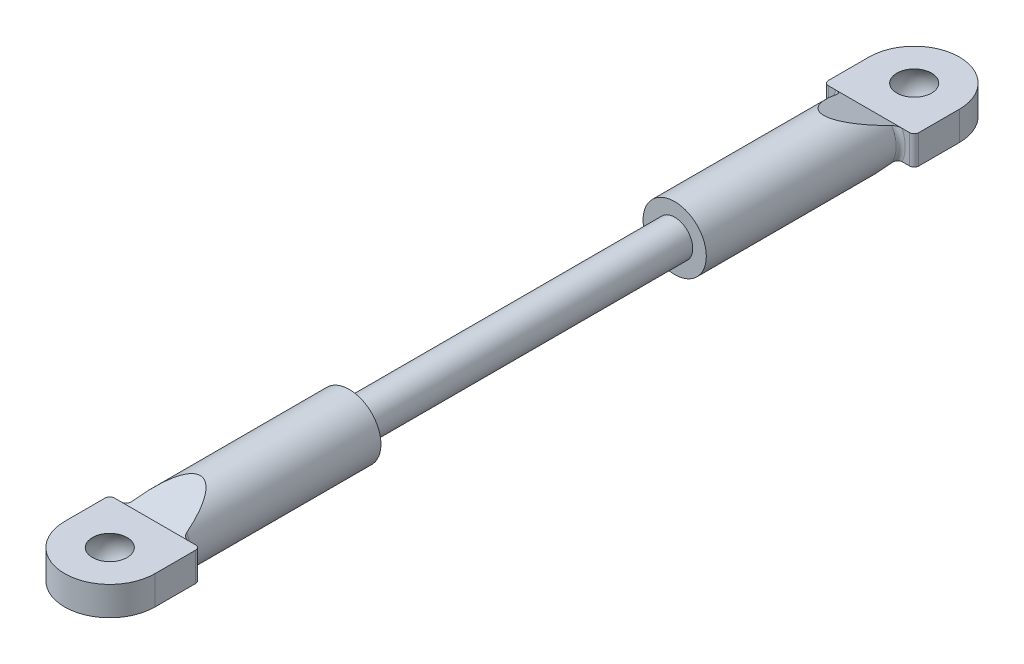
ISO-10303-21;
HEADER;
FILE_DESCRIPTION(('STEP AP214'),'2;1');
FILE_NAME('part.step','',(''),(''),'','','');
FILE_SCHEMA(('AUTOMOTIVE_DESIGN { 1 0 10303 214 1 1 1 1 }'));
ENDSEC;
DATA;
#1=APPLICATION_CONTEXT('core data for automotive mechanical design processes');
#2=APPLICATION_PROTOCOL_DEFINITION('international standard','automotive_design',2000,#1);
#3=PRODUCT_CONTEXT('',#1,'mechanical');
#4=PRODUCT('Part','Part','',(#3));
#5=PRODUCT_RELATED_PRODUCT_CATEGORY('part','',(#4));
#6=PRODUCT_DEFINITION_FORMATION('','',#4);
#7=PRODUCT_DEFINITION_CONTEXT('part definition',#1,'design');
#8=PRODUCT_DEFINITION('design','',#6,#7);
#9=PRODUCT_DEFINITION_SHAPE('','',#8);
#10=(LENGTH_UNIT() NAMED_UNIT(*) SI_UNIT(.MILLI.,.METRE.));
#11=(NAMED_UNIT(*) PLANE_ANGLE_UNIT() SI_UNIT($,.RADIAN.));
#12=(NAMED_UNIT(*) SI_UNIT($,.STERADIAN.) SOLID_ANGLE_UNIT());
#13=UNCERTAINTY_MEASURE_WITH_UNIT(LENGTH_MEASURE(1.E-05),#10,'distance_accuracy_value','');
#14=(GEOMETRIC_REPRESENTATION_CONTEXT(3) GLOBAL_UNCERTAINTY_ASSIGNED_CONTEXT((#13)) GLOBAL_UNIT_ASSIGNED_CONTEXT((#10,
#11,#12)) REPRESENTATION_CONTEXT('',''));
#15=CARTESIAN_POINT('',(0.,0.,0.));
#16=DIRECTION('',(0.,0.,1.));
#17=DIRECTION('',(1.,0.,0.));
#18=AXIS2_PLACEMENT_3D('',#15,#16,#17);
#19=CARTESIAN_POINT('',(0.,0.,-39.5));
#20=DIRECTION('',(0.,0.,1.));
#21=DIRECTION('',(1.,0.,0.));
#22=AXIS2_PLACEMENT_3D('',#19,#20,#21);
#23=CYLINDRICAL_SURFACE('',#22,3.5);
#24=CARTESIAN_POINT('',(0.,0.,-18.));
#25=DIRECTION('',(0.,0.,1.));
#26=DIRECTION('',(1.,0.,0.));
#27=AXIS2_PLACEMENT_3D('',#24,#25,#26);
#28=CIRCLE('',#27,3.5);
#29=CARTESIAN_POINT('',(3.5,0.,-18.));
#30=VERTEX_POINT('',#29);
#31=EDGE_CURVE('E186',#30,#30,#28,.T.);
#32=ORIENTED_EDGE('',*,*,#31,.F.);
#33=EDGE_LOOP('',(#32));
#34=FACE_BOUND('',#33,.T.);
#35=CARTESIAN_POINT('',(0.,0.,-43.7105263157895));
#36=DIRECTION('',(0.,0.934783580588349,-0.355217760623573));
#37=DIRECTION('',(0.,0.355217760623573,0.934783580588349));
#38=AXIS2_PLACEMENT_3D('',#35,#36,#37);
#39=ELLIPSE('',#38,9.85311093075939,3.5);
#40=CARTESIAN_POINT('',(3.00764027104306,1.79,-39.));
#41=VERTEX_POINT('',#40);
#42=CARTESIAN_POINT('',(-3.00764027104306,1.79,-39.));
#43=VERTEX_POINT('',#42);
#44=EDGE_CURVE('E513',#41,#43,#39,.F.);
#45=ORIENTED_EDGE('',*,*,#44,.T.);
#46=CARTESIAN_POINT('',(0.,0.,-39.));
#47=DIRECTION('',(0.,0.,1.));
#48=DIRECTION('',(1.,0.,0.));
#49=AXIS2_PLACEMENT_3D('',#46,#47,#48);
#50=CIRCLE('',#49,3.5);
#51=CARTESIAN_POINT('',(-3.00764027104306,-1.79,-39.));
#52=VERTEX_POINT('',#51);
#53=EDGE_CURVE('E367',#43,#52,#50,.T.);
#54=ORIENTED_EDGE('',*,*,#53,.T.);
#55=CARTESIAN_POINT('',(0.,0.,-43.7105263157895));
#56=DIRECTION('',(0.,-0.934783580588349,-0.355217760623573));
#57=DIRECTION('',(0.,-0.355217760623573,0.934783580588349));
#58=AXIS2_PLACEMENT_3D('',#55,#56,#57);
#59=ELLIPSE('',#58,9.85311093075939,3.5);
#60=CARTESIAN_POINT('',(3.00764027104306,-1.79,-39.));
#61=VERTEX_POINT('',#60);
#62=EDGE_CURVE('E210',#52,#61,#59,.F.);
#63=ORIENTED_EDGE('',*,*,#62,.T.);
#64=CARTESIAN_POINT('',(0.,0.,-39.));
#65=DIRECTION('',(0.,0.,1.));
#66=DIRECTION('',(1.,0.,0.));
#67=AXIS2_PLACEMENT_3D('',#64,#65,#66);
#68=CIRCLE('',#67,3.5);
#69=EDGE_CURVE('E364',#61,#41,#68,.T.);
#70=ORIENTED_EDGE('',*,*,#69,.T.);
#71=EDGE_LOOP('',(#45,#54,#63,#70));
#72=FACE_BOUND('',#71,.T.);
#73=ADVANCED_FACE('F37',(#34,#72),#23,.T.);
#74=CARTESIAN_POINT('',(0.,0.,18.));
#75=DIRECTION('',(0.,0.,-1.));
#76=DIRECTION('',(-1.,0.,0.));
#77=AXIS2_PLACEMENT_3D('',#74,#75,#76);
#78=CYLINDRICAL_SURFACE('',#77,2.);
#79=CARTESIAN_POINT('',(0.,0.,18.));
#80=DIRECTION('',(0.,0.,1.));
#81=DIRECTION('',(1.,0.,0.));
#82=AXIS2_PLACEMENT_3D('',#79,#80,#81);
#83=CIRCLE('',#82,2.);
#84=CARTESIAN_POINT('',(2.,0.,18.));
#85=VERTEX_POINT('',#84);
#86=EDGE_CURVE('E269',#85,#85,#83,.T.);
#87=ORIENTED_EDGE('',*,*,#86,.F.);
#88=EDGE_LOOP('',(#87));
#89=FACE_BOUND('',#88,.T.);
#90=CARTESIAN_POINT('',(0.,0.,-18.));
#91=DIRECTION('',(0.,0.,-1.));
#92=DIRECTION('',(-1.,0.,0.));
#93=AXIS2_PLACEMENT_3D('',#90,#91,#92);
#94=CIRCLE('',#93,2.);
#95=CARTESIAN_POINT('',(-2.,0.,-18.));
#96=VERTEX_POINT('',#95);
#97=EDGE_CURVE('E221',#96,#96,#94,.T.);
#98=ORIENTED_EDGE('',*,*,#97,.F.);
#99=EDGE_LOOP('',(#98));
#100=FACE_BOUND('',#99,.T.);
#101=ADVANCED_FACE('F425',(#89,#100),#78,.T.);
#102=CARTESIAN_POINT('',(0.,0.,39.5));
#103=DIRECTION('',(0.,0.,-1.));
#104=DIRECTION('',(-1.,0.,0.));
#105=AXIS2_PLACEMENT_3D('',#102,#103,#104);
#106=CYLINDRICAL_SURFACE('',#105,3.5);
#107=CARTESIAN_POINT('',(0.,0.,43.7105263157895));
#108=DIRECTION('',(0.,0.934783580588349,-0.355217760623573));
#109=DIRECTION('',(0.,-0.355217760623573,-0.934783580588349));
#110=AXIS2_PLACEMENT_3D('',#107,#108,#109);
#111=ELLIPSE('',#110,9.85311093075939,3.5);
#112=CARTESIAN_POINT('',(3.00764027104306,-1.79,39.));
#113=VERTEX_POINT('',#112);
#114=CARTESIAN_POINT('',(-3.00764027104306,-1.79,39.));
#115=VERTEX_POINT('',#114);
#116=EDGE_CURVE('E233',#113,#115,#111,.T.);
#117=ORIENTED_EDGE('',*,*,#116,.T.);
#118=CARTESIAN_POINT('',(0.,0.,39.));
#119=DIRECTION('',(0.,0.,1.));
#120=DIRECTION('',(1.,0.,0.));
#121=AXIS2_PLACEMENT_3D('',#118,#119,#120);
#122=CIRCLE('',#121,3.5);
#123=CARTESIAN_POINT('',(-3.00764027104306,1.79,39.));
#124=VERTEX_POINT('',#123);
#125=EDGE_CURVE('E290',#115,#124,#122,.F.);
#126=ORIENTED_EDGE('',*,*,#125,.T.);
#127=CARTESIAN_POINT('',(0.,0.,43.7105263157895));
#128=DIRECTION('',(0.,-0.934783580588349,-0.355217760623573));
#129=DIRECTION('',(0.,0.355217760623573,-0.934783580588349));
#130=AXIS2_PLACEMENT_3D('',#127,#128,#129);
#131=ELLIPSE('',#130,9.85311093075939,3.5);
#132=CARTESIAN_POINT('',(3.00764027104306,1.79,39.));
#133=VERTEX_POINT('',#132);
#134=EDGE_CURVE('E230',#124,#133,#131,.T.);
#135=ORIENTED_EDGE('',*,*,#134,.T.);
#136=CARTESIAN_POINT('',(0.,0.,39.));
#137=DIRECTION('',(0.,0.,1.));
#138=DIRECTION('',(1.,0.,0.));
#139=AXIS2_PLACEMENT_3D('',#136,#137,#138);
#140=CIRCLE('',#139,3.5);
#141=EDGE_CURVE('E288',#133,#113,#140,.F.);
#142=ORIENTED_EDGE('',*,*,#141,.T.);
#143=EDGE_LOOP('',(#117,#126,#135,#142));
#144=FACE_BOUND('',#143,.T.);
#145=CARTESIAN_POINT('',(0.,0.,18.));
#146=DIRECTION('',(0.,0.,1.));
#147=DIRECTION('',(1.,0.,0.));
#148=AXIS2_PLACEMENT_3D('',#145,#146,#147);
#149=CIRCLE('',#148,3.5);
#150=CARTESIAN_POINT('',(3.5,0.,18.));
#151=VERTEX_POINT('',#150);
#152=EDGE_CURVE('E266',#151,#151,#149,.T.);
#153=ORIENTED_EDGE('',*,*,#152,.T.);
#154=EDGE_LOOP('',(#153));
#155=FACE_BOUND('',#154,.T.);
#156=ADVANCED_FACE('F486',(#144,#155),#106,.T.);
#157=CARTESIAN_POINT('',(0.,0.,18.));
#158=DIRECTION('',(0.,0.,1.));
#159=DIRECTION('',(1.,0.,0.));
#160=AXIS2_PLACEMENT_3D('',#157,#158,#159);
#161=PLANE('',#160);
#162=ORIENTED_EDGE('',*,*,#86,.T.);
#163=EDGE_LOOP('',(#162));
#164=FACE_BOUND('',#163,.T.);
#165=ORIENTED_EDGE('',*,*,#152,.F.);
#166=EDGE_LOOP('',(#165));
#167=FACE_BOUND('',#166,.T.);
#168=ADVANCED_FACE('F489',(#164,#167),#161,.F.);
#169=CARTESIAN_POINT('',(4.99999999999995,1.6,39.5));
#170=DIRECTION('',(0.,0.,1.));
#171=DIRECTION('',(1.,0.,0.));
#172=AXIS2_PLACEMENT_3D('',#169,#170,#171);
#173=PLANE('',#172);
#174=DIRECTION('',(-1.,0.,0.));
#175=VECTOR('',#174,1.);
#176=CARTESIAN_POINT('',(4.99999999999995,-1.6,39.5));
#177=LINE('',#176,#175);
#178=CARTESIAN_POINT('',(-3.66606055596467,-1.6,39.5));
#179=VERTEX_POINT('',#178);
#180=CARTESIAN_POINT('',(-4.50000000000005,-1.6,39.5));
#181=VERTEX_POINT('',#180);
#182=EDGE_CURVE('E253',#179,#181,#177,.T.);
#183=ORIENTED_EDGE('',*,*,#182,.T.);
#184=DIRECTION('',(0.,-1.,0.));
#185=VECTOR('',#184,1.);
#186=CARTESIAN_POINT('',(-4.50000000000005,1.6,39.5));
#187=LINE('',#186,#185);
#188=CARTESIAN_POINT('',(-4.50000000000005,1.6,39.5));
#189=VERTEX_POINT('',#188);
#190=EDGE_CURVE('E282',#181,#189,#187,.F.);
#191=ORIENTED_EDGE('',*,*,#190,.T.);
#192=DIRECTION('',(-1.,0.,0.));
#193=VECTOR('',#192,1.);
#194=CARTESIAN_POINT('',(4.99999999999995,1.6,39.5));
#195=LINE('',#194,#193);
#196=CARTESIAN_POINT('',(-3.66606055596467,1.6,39.5));
#197=VERTEX_POINT('',#196);
#198=EDGE_CURVE('E240',#197,#189,#195,.T.);
#199=ORIENTED_EDGE('',*,*,#198,.F.);
#200=CARTESIAN_POINT('',(0.,0.,39.5));
#201=DIRECTION('',(0.,0.,1.));
#202=DIRECTION('',(1.,0.,0.));
#203=AXIS2_PLACEMENT_3D('',#200,#201,#202);
#204=CIRCLE('',#203,4.);
#205=EDGE_CURVE('E279',#197,#179,#204,.T.);
#206=ORIENTED_EDGE('',*,*,#205,.T.);
#207=EDGE_LOOP('',(#183,#191,#199,#206));
#208=FACE_BOUND('',#207,.T.);
#209=ADVANCED_FACE('F454',(#208),#173,.F.);
#210=CARTESIAN_POINT('',(4.49999999999995,1.6,39.5));
#211=VERTEX_POINT('',#210);
#212=CARTESIAN_POINT('',(3.66606055596467,1.6,39.5));
#213=VERTEX_POINT('',#212);
#214=EDGE_CURVE('E242',#211,#213,#195,.T.);
#215=ORIENTED_EDGE('',*,*,#214,.F.);
#216=DIRECTION('',(0.,-1.,0.));
#217=VECTOR('',#216,1.);
#218=CARTESIAN_POINT('',(4.49999999999995,1.6,39.5));
#219=LINE('',#218,#217);
#220=CARTESIAN_POINT('',(4.49999999999995,-1.6,39.5));
#221=VERTEX_POINT('',#220);
#222=EDGE_CURVE('E295',#211,#221,#219,.T.);
#223=ORIENTED_EDGE('',*,*,#222,.T.);
#224=CARTESIAN_POINT('',(3.66606055596467,-1.6,39.5));
#225=VERTEX_POINT('',#224);
#226=EDGE_CURVE('E254',#221,#225,#177,.T.);
#227=ORIENTED_EDGE('',*,*,#226,.T.);
#228=CARTESIAN_POINT('',(0.,0.,39.5));
#229=DIRECTION('',(0.,0.,1.));
#230=DIRECTION('',(1.,0.,0.));
#231=AXIS2_PLACEMENT_3D('',#228,#229,#230);
#232=CIRCLE('',#231,4.);
#233=EDGE_CURVE('E292',#225,#213,#232,.T.);
#234=ORIENTED_EDGE('',*,*,#233,.T.);
#235=EDGE_LOOP('',(#215,#223,#227,#234));
#236=FACE_BOUND('',#235,.T.);
#237=ADVANCED_FACE('F482',(#236),#173,.F.);
#238=CARTESIAN_POINT('',(4.99999999999995,1.6,39.5));
#239=DIRECTION('',(-1.,0.,0.));
#240=DIRECTION('',(0.,0.,1.));
#241=AXIS2_PLACEMENT_3D('',#238,#239,#240);
#242=PLANE('',#241);
#243=DIRECTION('',(0.,0.,-1.));
#244=VECTOR('',#243,1.);
#245=CARTESIAN_POINT('',(4.99999999999995,-1.6,39.5));
#246=LINE('',#245,#244);
#247=CARTESIAN_POINT('',(4.99999999999995,-1.6,44.5));
#248=VERTEX_POINT('',#247);
#249=CARTESIAN_POINT('',(4.99999999999995,-1.6,40.));
#250=VERTEX_POINT('',#249);
#251=EDGE_CURVE('E236',#248,#250,#246,.T.);
#252=ORIENTED_EDGE('',*,*,#251,.T.);
#253=DIRECTION('',(0.,-1.,0.));
#254=VECTOR('',#253,1.);
#255=CARTESIAN_POINT('',(4.99999999999995,1.6,40.));
#256=LINE('',#255,#254);
#257=CARTESIAN_POINT('',(4.99999999999995,1.6,40.));
#258=VERTEX_POINT('',#257);
#259=EDGE_CURVE('E298',#250,#258,#256,.F.);
#260=ORIENTED_EDGE('',*,*,#259,.T.);
#261=DIRECTION('',(0.,0.,-1.));
#262=VECTOR('',#261,1.);
#263=CARTESIAN_POINT('',(4.99999999999995,1.6,39.5));
#264=LINE('',#263,#262);
#265=CARTESIAN_POINT('',(4.99999999999995,1.6,44.5));
#266=VERTEX_POINT('',#265);
#267=EDGE_CURVE('E237',#266,#258,#264,.T.);
#268=ORIENTED_EDGE('',*,*,#267,.F.);
#269=DIRECTION('',(0.,-1.,0.));
#270=VECTOR('',#269,1.);
#271=CARTESIAN_POINT('',(4.99999999999995,1.6,44.5));
#272=LINE('',#271,#270);
#273=EDGE_CURVE('E250',#266,#248,#272,.T.);
#274=ORIENTED_EDGE('',*,*,#273,.T.);
#275=EDGE_LOOP('',(#252,#260,#268,#274));
#276=FACE_BOUND('',#275,.T.);
#277=ADVANCED_FACE('F476',(#276),#242,.F.);
#278=CARTESIAN_POINT('',(-5.00000000000005,1.6,39.5));
#279=DIRECTION('',(1.,0.,0.));
#280=DIRECTION('',(0.,0.,-1.));
#281=AXIS2_PLACEMENT_3D('',#278,#279,#280);
#282=PLANE('',#281);
#283=DIRECTION('',(0.,0.,1.));
#284=VECTOR('',#283,1.);
#285=CARTESIAN_POINT('',(-5.00000000000005,1.6,39.5));
#286=LINE('',#285,#284);
#287=CARTESIAN_POINT('',(-5.00000000000005,1.6,40.));
#288=VERTEX_POINT('',#287);
#289=CARTESIAN_POINT('',(-5.00000000000005,1.6,44.5));
#290=VERTEX_POINT('',#289);
#291=EDGE_CURVE('E245',#288,#290,#286,.T.);
#292=ORIENTED_EDGE('',*,*,#291,.F.);
#293=DIRECTION('',(0.,-1.,0.));
#294=VECTOR('',#293,1.);
#295=CARTESIAN_POINT('',(-5.00000000000005,1.6,40.));
#296=LINE('',#295,#294);
#297=CARTESIAN_POINT('',(-5.00000000000005,-1.6,40.));
#298=VERTEX_POINT('',#297);
#299=EDGE_CURVE('E272',#288,#298,#296,.T.);
#300=ORIENTED_EDGE('',*,*,#299,.T.);
#301=DIRECTION('',(0.,0.,1.));
#302=VECTOR('',#301,1.);
#303=CARTESIAN_POINT('',(-5.00000000000005,-1.6,39.5));
#304=LINE('',#303,#302);
#305=CARTESIAN_POINT('',(-5.00000000000005,-1.6,44.5));
#306=VERTEX_POINT('',#305);
#307=EDGE_CURVE('E257',#298,#306,#304,.T.);
#308=ORIENTED_EDGE('',*,*,#307,.T.);
#309=DIRECTION('',(0.,-1.,0.));
#310=VECTOR('',#309,1.);
#311=CARTESIAN_POINT('',(-5.00000000000005,1.6,44.5));
#312=LINE('',#311,#310);
#313=EDGE_CURVE('E263',#290,#306,#312,.T.);
#314=ORIENTED_EDGE('',*,*,#313,.F.);
#315=EDGE_LOOP('',(#292,#300,#308,#314));
#316=FACE_BOUND('',#315,.T.);
#317=ADVANCED_FACE('F466',(#316),#282,.F.);
#318=CARTESIAN_POINT('',(0.,1.6,44.5));
#319=DIRECTION('',(0.,-1.,0.));
#320=DIRECTION('',(0.,0.,-1.));
#321=AXIS2_PLACEMENT_3D('',#318,#319,#320);
#322=CYLINDRICAL_SURFACE('',#321,5.);
#323=CARTESIAN_POINT('',(0.,-1.6,44.5));
#324=DIRECTION('',(0.,1.,0.));
#325=DIRECTION('',(0.,0.,1.));
#326=AXIS2_PLACEMENT_3D('',#323,#324,#325);
#327=CIRCLE('',#326,5.);
#328=EDGE_CURVE('E241',#306,#248,#327,.T.);
#329=ORIENTED_EDGE('',*,*,#328,.T.);
#330=ORIENTED_EDGE('',*,*,#273,.F.);
#331=CARTESIAN_POINT('',(0.,1.6,44.5));
#332=DIRECTION('',(0.,1.,0.));
#333=DIRECTION('',(0.,0.,1.));
#334=AXIS2_PLACEMENT_3D('',#331,#332,#333);
#335=CIRCLE('',#334,5.);
#336=EDGE_CURVE('E248',#290,#266,#335,.T.);
#337=ORIENTED_EDGE('',*,*,#336,.F.);
#338=ORIENTED_EDGE('',*,*,#313,.T.);
#339=EDGE_LOOP('',(#329,#330,#337,#338));
#340=FACE_BOUND('',#339,.T.);
#341=ADVANCED_FACE('F472',(#340),#322,.T.);
#342=CARTESIAN_POINT('',(0.,1.6,44.5));
#343=DIRECTION('',(0.,1.,0.));
#344=DIRECTION('',(0.,0.,1.));
#345=AXIS2_PLACEMENT_3D('',#342,#343,#344);
#346=PLANE('',#345);
#347=CARTESIAN_POINT('',(0.,1.6,44.5));
#348=DIRECTION('',(0.,-1.,0.));
#349=DIRECTION('',(0.,0.,-1.));
#350=AXIS2_PLACEMENT_3D('',#347,#348,#349);
#351=CIRCLE('',#350,1.92093727122986);
#352=CARTESIAN_POINT('',(0.,1.6,42.5790627287701));
#353=VERTEX_POINT('',#352);
#354=EDGE_CURVE('E227',#353,#353,#351,.T.);
#355=ORIENTED_EDGE('',*,*,#354,.T.);
#356=EDGE_LOOP('',(#355));
#357=FACE_BOUND('',#356,.T.);
#358=ORIENTED_EDGE('',*,*,#198,.T.);
#359=CARTESIAN_POINT('',(-4.50000000000005,1.6,40.));
#360=DIRECTION('',(0.,1.,0.));
#361=DIRECTION('',(0.,0.,1.));
#362=AXIS2_PLACEMENT_3D('',#359,#360,#361);
#363=CIRCLE('',#362,0.5);
#364=EDGE_CURVE('E286',#189,#288,#363,.T.);
#365=ORIENTED_EDGE('',*,*,#364,.T.);
#366=ORIENTED_EDGE('',*,*,#291,.T.);
#367=ORIENTED_EDGE('',*,*,#336,.T.);
#368=ORIENTED_EDGE('',*,*,#267,.T.);
#369=CARTESIAN_POINT('',(4.49999999999995,1.6,40.));
#370=DIRECTION('',(0.,1.,0.));
#371=DIRECTION('',(0.,0.,1.));
#372=AXIS2_PLACEMENT_3D('',#369,#370,#371);
#373=CIRCLE('',#372,0.5);
#374=EDGE_CURVE('E284',#258,#211,#373,.T.);
#375=ORIENTED_EDGE('',*,*,#374,.T.);
#376=ORIENTED_EDGE('',*,*,#214,.T.);
#377=EDGE_CURVE('E246',#213,#197,#195,.T.);
#378=ORIENTED_EDGE('',*,*,#377,.T.);
#379=EDGE_LOOP('',(#358,#365,#366,#367,#368,#375,#376,#378));
#380=FACE_BOUND('',#379,.T.);
#381=ADVANCED_FACE('F462',(#357,#380),#346,.T.);
#382=CARTESIAN_POINT('',(0.,-1.6,44.5));
#383=DIRECTION('',(0.,1.,0.));
#384=DIRECTION('',(0.,0.,1.));
#385=AXIS2_PLACEMENT_3D('',#382,#383,#384);
#386=PLANE('',#385);
#387=CARTESIAN_POINT('',(0.,-1.6,44.5));
#388=DIRECTION('',(0.,-1.,0.));
#389=DIRECTION('',(0.,0.,-1.));
#390=AXIS2_PLACEMENT_3D('',#387,#388,#389);
#391=CIRCLE('',#390,1.92093727122986);
#392=CARTESIAN_POINT('',(0.,-1.6,42.5790627287701));
#393=VERTEX_POINT('',#392);
#394=EDGE_CURVE('E224',#393,#393,#391,.T.);
#395=ORIENTED_EDGE('',*,*,#394,.F.);
#396=EDGE_LOOP('',(#395));
#397=FACE_BOUND('',#396,.T.);
#398=ORIENTED_EDGE('',*,*,#307,.F.);
#399=CARTESIAN_POINT('',(-4.50000000000005,-1.6,40.));
#400=DIRECTION('',(0.,1.,0.));
#401=DIRECTION('',(0.,0.,1.));
#402=AXIS2_PLACEMENT_3D('',#399,#400,#401);
#403=CIRCLE('',#402,0.5);
#404=EDGE_CURVE('E277',#298,#181,#403,.F.);
#405=ORIENTED_EDGE('',*,*,#404,.T.);
#406=ORIENTED_EDGE('',*,*,#182,.F.);
#407=EDGE_CURVE('E258',#225,#179,#177,.T.);
#408=ORIENTED_EDGE('',*,*,#407,.F.);
#409=ORIENTED_EDGE('',*,*,#226,.F.);
#410=CARTESIAN_POINT('',(4.49999999999995,-1.6,40.));
#411=DIRECTION('',(0.,1.,0.));
#412=DIRECTION('',(0.,0.,1.));
#413=AXIS2_PLACEMENT_3D('',#410,#411,#412);
#414=CIRCLE('',#413,0.5);
#415=EDGE_CURVE('E275',#221,#250,#414,.F.);
#416=ORIENTED_EDGE('',*,*,#415,.T.);
#417=ORIENTED_EDGE('',*,*,#251,.F.);
#418=ORIENTED_EDGE('',*,*,#328,.F.);
#419=EDGE_LOOP('',(#398,#405,#406,#408,#409,#416,#417,#418));
#420=FACE_BOUND('',#419,.T.);
#421=ADVANCED_FACE('F439',(#397,#420),#386,.F.);
#422=CARTESIAN_POINT('',(-5.00000000000005,-3.5,34.5));
#423=DIRECTION('',(0.,0.934783580588349,-0.355217760623573));
#424=DIRECTION('',(0.,0.355217760623573,0.934783580588349));
#425=AXIS2_PLACEMENT_3D('',#422,#423,#424);
#426=PLANE('',#425);
#427=ORIENTED_EDGE('',*,*,#116,.F.);
#428=CARTESIAN_POINT('',(3.00764027104306,-1.79,39.));
#429=CARTESIAN_POINT('',(3.01501660801302,-1.77766028795213,39.0324729264418));
#430=CARTESIAN_POINT('',(3.02572054444839,-1.76562370557432,39.0641481432255));
#431=CARTESIAN_POINT('',(3.05268143397384,-1.74243941655702,39.1251594301131));
#432=CARTESIAN_POINT('',(3.06890462643524,-1.73128680248826,39.1545084145046));
#433=CARTESIAN_POINT('',(3.10582578109096,-1.71005107968239,39.2103918955726));
#434=CARTESIAN_POINT('',(3.12650175541777,-1.69996306618932,39.2369392995018));
#435=CARTESIAN_POINT('',(3.17173377932213,-1.68091062474513,39.2870773033023));
#436=CARTESIAN_POINT('',(3.1963000098391,-1.67194925885705,39.310659845113));
#437=CARTESIAN_POINT('',(3.25308702665305,-1.65394324157303,39.3580441011236));
#438=CARTESIAN_POINT('',(3.28590126291054,-1.64513316555967,39.3812285116851));
#439=CARTESIAN_POINT('',(3.35512262024705,-1.62958502321958,39.4221446757379));
#440=CARTESIAN_POINT('',(3.39152193222908,-1.62284257946172,39.4398879487849));
#441=CARTESIAN_POINT('',(3.46667654312686,-1.61181855552478,39.4688985380927));
#442=CARTESIAN_POINT('',(3.50539569079469,-1.60750655943475,39.4802458962243));
#443=CARTESIAN_POINT('',(3.58468972563839,-1.60158887924979,39.4958187388163));
#444=CARTESIAN_POINT('',(3.62527552224046,-1.60000196579963,39.4999948268431));
#445=CARTESIAN_POINT('',(3.66606055596467,-1.6,39.5));
#446=B_SPLINE_CURVE_WITH_KNOTS('',3,(#428,#429,#430,#431,#432,#433,#434,#435,#436,#437,#438,
#439,#440,#441,#442,#443,#444,#445),.UNSPECIFIED.,.F.,.F.,(4,2,2,2,2,2,2,2,4),(0.,
0.106167992198196,0.211697907824557,0.316718199165379,0.422018018143723,0.544850735918064,
0.667421577236032,0.788422358006248,0.910253310178007),.UNSPECIFIED.);
#447=EDGE_CURVE('E343',#113,#225,#446,.T.);
#448=ORIENTED_EDGE('',*,*,#447,.T.);
#449=ORIENTED_EDGE('',*,*,#407,.T.);
#450=CARTESIAN_POINT('',(-3.66606055596467,-1.6,39.5));
#451=CARTESIAN_POINT('',(-3.63078063888977,-1.60000001056058,39.499999972209));
#452=CARTESIAN_POINT('',(-3.5956179181408,-1.60118986581098,39.4968687741816));
#453=CARTESIAN_POINT('',(-3.52655388189509,-1.60567025143002,39.4850782857105));
#454=CARTESIAN_POINT('',(-3.49264665949915,-1.60894911259673,39.4764497036928));
#455=CARTESIAN_POINT('',(-3.42683574135487,-1.61731864154893,39.4544246275028));
#456=CARTESIAN_POINT('',(-3.39492497711937,-1.62240243525609,39.4410462230103));
#457=CARTESIAN_POINT('',(-3.33346675755787,-1.63416518792784,39.4100916107162));
#458=CARTESIAN_POINT('',(-3.30392365430699,-1.64084699836385,39.3925078990425));
#459=CARTESIAN_POINT('',(-3.24361803739982,-1.65669629654687,39.3507992196135));
#460=CARTESIAN_POINT('',(-3.2133145497666,-1.66608478340738,39.3260926752437));
#461=CARTESIAN_POINT('',(-3.15729695298565,-1.68646854640408,39.2724511936735));
#462=CARTESIAN_POINT('',(-3.13158499781672,-1.69746457229264,39.2435142834404));
#463=CARTESIAN_POINT('',(-3.08849280363674,-1.71942769351274,39.1857165960191));
#464=CARTESIAN_POINT('',(-3.07048210952563,-1.73023882163715,39.1572662588496));
#465=CARTESIAN_POINT('',(-3.03967295120166,-1.7527379284266,39.0980580830879));
#466=CARTESIAN_POINT('',(-3.02685556067101,-1.76442253590269,39.0673091160455));
#467=CARTESIAN_POINT('',(-3.01354455450079,-1.7809023956061,39.0239410641945));
#468=CARTESIAN_POINT('',(-3.01035806349222,-1.78543358828867,39.0120168729245));
#469=CARTESIAN_POINT('',(-3.00764027104306,-1.79,39.));
#470=B_SPLINE_CURVE_WITH_KNOTS('',3,(#450,#451,#452,#453,#454,#455,#456,#457,#458,#459,#460,
#461,#462,#463,#464,#465,#466,#467,#468,#469),.UNSPECIFIED.,.F.,.F.,(4,2,2,2,2,2,2,2,2,4),(0.,
0.105514918398725,0.210445536564004,0.314980739690672,0.419703883801088,0.539819680998129,
0.659991679707302,0.765692662085826,0.871004889168675,0.910420537913499),.UNSPECIFIED.);
#471=EDGE_CURVE('E300',#179,#115,#470,.T.);
#472=ORIENTED_EDGE('',*,*,#471,.T.);
#473=EDGE_LOOP('',(#427,#448,#449,#472));
#474=FACE_BOUND('',#473,.T.);
#475=ADVANCED_FACE('F313',(#474),#426,.F.);
#476=CARTESIAN_POINT('',(-5.00000000000005,3.5,34.5));
#477=DIRECTION('',(0.,-0.934783580588349,-0.355217760623573));
#478=DIRECTION('',(0.,0.355217760623573,-0.934783580588349));
#479=AXIS2_PLACEMENT_3D('',#476,#477,#478);
#480=PLANE('',#479);
#481=ORIENTED_EDGE('',*,*,#134,.F.);
#482=CARTESIAN_POINT('',(-3.00764027104306,1.79,39.));
#483=CARTESIAN_POINT('',(-3.01501660801302,1.77766028795213,39.0324729264418));
#484=CARTESIAN_POINT('',(-3.02572054444839,1.76562370557432,39.0641481432255));
#485=CARTESIAN_POINT('',(-3.05268143397384,1.74243941655702,39.1251594301131));
#486=CARTESIAN_POINT('',(-3.06890462643524,1.73128680248826,39.1545084145046));
#487=CARTESIAN_POINT('',(-3.10582578109096,1.71005107968239,39.2103918955726));
#488=CARTESIAN_POINT('',(-3.12650175541777,1.69996306618932,39.2369392995018));
#489=CARTESIAN_POINT('',(-3.17173377932213,1.68091062474513,39.2870773033023));
#490=CARTESIAN_POINT('',(-3.1963000098391,1.67194925885705,39.310659845113));
#491=CARTESIAN_POINT('',(-3.25308702665305,1.65394324157303,39.3580441011236));
#492=CARTESIAN_POINT('',(-3.28590126291054,1.64513316555967,39.3812285116851));
#493=CARTESIAN_POINT('',(-3.35512262024705,1.62958502321958,39.4221446757379));
#494=CARTESIAN_POINT('',(-3.39152193222908,1.62284257946172,39.4398879487849));
#495=CARTESIAN_POINT('',(-3.46667654312686,1.61181855552478,39.4688985380927));
#496=CARTESIAN_POINT('',(-3.50539569079469,1.60750655943475,39.4802458962243));
#497=CARTESIAN_POINT('',(-3.58468972563839,1.60158887924979,39.4958187388163));
#498=CARTESIAN_POINT('',(-3.62527552224046,1.60000196579963,39.4999948268431));
#499=CARTESIAN_POINT('',(-3.66606055596467,1.6,39.5));
#500=B_SPLINE_CURVE_WITH_KNOTS('',3,(#482,#483,#484,#485,#486,#487,#488,#489,#490,#491,#492,
#493,#494,#495,#496,#497,#498,#499),.UNSPECIFIED.,.F.,.F.,(4,2,2,2,2,2,2,2,4),(0.,
0.106167992198196,0.211697907824557,0.316718199165379,0.422018018143723,0.544850735918064,
0.667421577236032,0.788422358006248,0.910253310178007),.UNSPECIFIED.);
#501=EDGE_CURVE('E307',#124,#197,#500,.T.);
#502=ORIENTED_EDGE('',*,*,#501,.T.);
#503=ORIENTED_EDGE('',*,*,#377,.F.);
#504=CARTESIAN_POINT('',(3.66606055596467,1.6,39.5));
#505=CARTESIAN_POINT('',(3.63078063888977,1.60000001056058,39.499999972209));
#506=CARTESIAN_POINT('',(3.5956179181408,1.60118986581098,39.4968687741816));
#507=CARTESIAN_POINT('',(3.52655388189509,1.60567025143002,39.4850782857105));
#508=CARTESIAN_POINT('',(3.49264665949915,1.60894911259673,39.4764497036928));
#509=CARTESIAN_POINT('',(3.42683574135487,1.61731864154893,39.4544246275028));
#510=CARTESIAN_POINT('',(3.39492497711937,1.62240243525609,39.4410462230103));
#511=CARTESIAN_POINT('',(3.33346675755787,1.63416518792784,39.4100916107162));
#512=CARTESIAN_POINT('',(3.30392365430699,1.64084699836385,39.3925078990425));
#513=CARTESIAN_POINT('',(3.24361803739982,1.65669629654687,39.3507992196135));
#514=CARTESIAN_POINT('',(3.2133145497666,1.66608478340738,39.3260926752437));
#515=CARTESIAN_POINT('',(3.15729695298565,1.68646854640408,39.2724511936735));
#516=CARTESIAN_POINT('',(3.13158499781672,1.69746457229264,39.2435142834404));
#517=CARTESIAN_POINT('',(3.08849280363674,1.71942769351274,39.1857165960191));
#518=CARTESIAN_POINT('',(3.07048210952563,1.73023882163715,39.1572662588496));
#519=CARTESIAN_POINT('',(3.03967295120166,1.7527379284266,39.0980580830879));
#520=CARTESIAN_POINT('',(3.02685556067101,1.76442253590269,39.0673091160455));
#521=CARTESIAN_POINT('',(3.01354455450079,1.7809023956061,39.0239410641945));
#522=CARTESIAN_POINT('',(3.01035806349222,1.78543358828867,39.0120168729245));
#523=CARTESIAN_POINT('',(3.00764027104306,1.79,39.));
#524=B_SPLINE_CURVE_WITH_KNOTS('',3,(#504,#505,#506,#507,#508,#509,#510,#511,#512,#513,#514,
#515,#516,#517,#518,#519,#520,#521,#522,#523),.UNSPECIFIED.,.F.,.F.,(4,2,2,2,2,2,2,2,2,4),(0.,
0.105514918398725,0.210445536564004,0.314980739690672,0.419703883801088,0.539819680998129,
0.659991679707302,0.765692662085826,0.871004889168674,0.910420537913499),.UNSPECIFIED.);
#525=EDGE_CURVE('E338',#213,#133,#524,.T.);
#526=ORIENTED_EDGE('',*,*,#525,.T.);
#527=EDGE_LOOP('',(#481,#502,#503,#526));
#528=FACE_BOUND('',#527,.T.);
#529=ADVANCED_FACE('F429',(#528),#480,.F.);
#530=CARTESIAN_POINT('',(-4.50000000000005,1.6,40.));
#531=DIRECTION('',(0.,-1.,0.));
#532=DIRECTION('',(0.,0.,-1.));
#533=AXIS2_PLACEMENT_3D('',#530,#531,#532);
#534=CYLINDRICAL_SURFACE('',#533,0.5);
#535=ORIENTED_EDGE('',*,*,#364,.F.);
#536=ORIENTED_EDGE('',*,*,#190,.F.);
#537=ORIENTED_EDGE('',*,*,#404,.F.);
#538=ORIENTED_EDGE('',*,*,#299,.F.);
#539=EDGE_LOOP('',(#535,#536,#537,#538));
#540=FACE_BOUND('',#539,.T.);
#541=ADVANCED_FACE('F322',(#540),#534,.T.);
#542=CARTESIAN_POINT('',(0.,0.,39.));
#543=DIRECTION('',(0.,0.,1.));
#544=DIRECTION('',(1.,0.,0.));
#545=AXIS2_PLACEMENT_3D('',#542,#543,#544);
#546=TOROIDAL_SURFACE('',#545,4.,0.5);
#547=ORIENTED_EDGE('',*,*,#501,.F.);
#548=ORIENTED_EDGE('',*,*,#125,.F.);
#549=ORIENTED_EDGE('',*,*,#471,.F.);
#550=ORIENTED_EDGE('',*,*,#205,.F.);
#551=EDGE_LOOP('',(#547,#548,#549,#550));
#552=FACE_BOUND('',#551,.T.);
#553=ADVANCED_FACE('F316',(#552),#546,.F.);
#554=CARTESIAN_POINT('',(4.49999999999995,1.6,40.));
#555=DIRECTION('',(0.,-1.,0.));
#556=DIRECTION('',(0.,0.,-1.));
#557=AXIS2_PLACEMENT_3D('',#554,#555,#556);
#558=CYLINDRICAL_SURFACE('',#557,0.5);
#559=ORIENTED_EDGE('',*,*,#374,.F.);
#560=ORIENTED_EDGE('',*,*,#259,.F.);
#561=ORIENTED_EDGE('',*,*,#415,.F.);
#562=ORIENTED_EDGE('',*,*,#222,.F.);
#563=EDGE_LOOP('',(#559,#560,#561,#562));
#564=FACE_BOUND('',#563,.T.);
#565=ADVANCED_FACE('F321',(#564),#558,.T.);
#566=CARTESIAN_POINT('',(0.,0.,39.));
#567=DIRECTION('',(0.,0.,1.));
#568=DIRECTION('',(1.,0.,0.));
#569=AXIS2_PLACEMENT_3D('',#566,#567,#568);
#570=TOROIDAL_SURFACE('',#569,4.,0.5);
#571=ORIENTED_EDGE('',*,*,#447,.F.);
#572=ORIENTED_EDGE('',*,*,#141,.F.);
#573=ORIENTED_EDGE('',*,*,#525,.F.);
#574=ORIENTED_EDGE('',*,*,#233,.F.);
#575=EDGE_LOOP('',(#571,#572,#573,#574));
#576=FACE_BOUND('',#575,.T.);
#577=ADVANCED_FACE('F328',(#576),#570,.F.);
#578=CARTESIAN_POINT('',(0.,0.,44.5));
#579=DIRECTION('',(0.,-1.,0.));
#580=DIRECTION('',(0.,0.,1.));
#581=AXIS2_PLACEMENT_3D('',#578,#579,#580);
#582=SPHERICAL_SURFACE('',#581,2.5);
#583=ORIENTED_EDGE('',*,*,#394,.T.);
#584=EDGE_LOOP('',(#583));
#585=FACE_BOUND('',#584,.T.);
#586=ORIENTED_EDGE('',*,*,#354,.F.);
#587=EDGE_LOOP('',(#586));
#588=FACE_BOUND('',#587,.T.);
#589=ADVANCED_FACE('F333',(#585,#588),#582,.F.);
#590=CARTESIAN_POINT('',(0.,0.,-18.));
#591=DIRECTION('',(0.,0.,-1.));
#592=DIRECTION('',(1.,0.,0.));
#593=AXIS2_PLACEMENT_3D('',#590,#591,#592);
#594=PLANE('',#593);
#595=ORIENTED_EDGE('',*,*,#97,.T.);
#596=EDGE_LOOP('',(#595));
#597=FACE_BOUND('',#596,.T.);
#598=ORIENTED_EDGE('',*,*,#31,.T.);
#599=EDGE_LOOP('',(#598));
#600=FACE_BOUND('',#599,.T.);
#601=ADVANCED_FACE('F411',(#597,#600),#594,.F.);
#602=CARTESIAN_POINT('',(4.99999999999995,1.6,-39.5));
#603=DIRECTION('',(0.,0.,1.));
#604=DIRECTION('',(1.,0.,0.));
#605=AXIS2_PLACEMENT_3D('',#602,#603,#604);
#606=PLANE('',#605);
#607=DIRECTION('',(-1.,0.,0.));
#608=VECTOR('',#607,1.);
#609=CARTESIAN_POINT('',(4.99999999999995,1.6,-39.5));
#610=LINE('',#609,#608);
#611=CARTESIAN_POINT('',(-3.66606055596467,1.6,-39.5));
#612=VERTEX_POINT('',#611);
#613=CARTESIAN_POINT('',(-4.50000000000005,1.6,-39.5));
#614=VERTEX_POINT('',#613);
#615=EDGE_CURVE('E202',#612,#614,#610,.T.);
#616=ORIENTED_EDGE('',*,*,#615,.T.);
#617=DIRECTION('',(0.,-1.,0.));
#618=VECTOR('',#617,1.);
#619=CARTESIAN_POINT('',(-4.50000000000005,1.6,-39.5));
#620=LINE('',#619,#618);
#621=CARTESIAN_POINT('',(-4.50000000000005,-1.6,-39.5));
#622=VERTEX_POINT('',#621);
#623=EDGE_CURVE('E352',#614,#622,#620,.T.);
#624=ORIENTED_EDGE('',*,*,#623,.T.);
#625=DIRECTION('',(-1.,0.,0.));
#626=VECTOR('',#625,1.);
#627=CARTESIAN_POINT('',(4.99999999999995,-1.6,-39.5));
#628=LINE('',#627,#626);
#629=CARTESIAN_POINT('',(-3.66606055596467,-1.6,-39.5));
#630=VERTEX_POINT('',#629);
#631=EDGE_CURVE('E214',#630,#622,#628,.T.);
#632=ORIENTED_EDGE('',*,*,#631,.F.);
#633=CARTESIAN_POINT('',(0.,0.,-39.5));
#634=DIRECTION('',(0.,0.,1.));
#635=DIRECTION('',(1.,0.,0.));
#636=AXIS2_PLACEMENT_3D('',#633,#634,#635);
#637=CIRCLE('',#636,4.);
#638=EDGE_CURVE('E349',#630,#612,#637,.F.);
#639=ORIENTED_EDGE('',*,*,#638,.T.);
#640=EDGE_LOOP('',(#616,#624,#632,#639));
#641=FACE_BOUND('',#640,.T.);
#642=ADVANCED_FACE('F407',(#641),#606,.T.);
#643=CARTESIAN_POINT('',(4.49999999999995,-1.6,-39.5));
#644=VERTEX_POINT('',#643);
#645=CARTESIAN_POINT('',(3.66606055596467,-1.6,-39.5));
#646=VERTEX_POINT('',#645);
#647=EDGE_CURVE('E195',#644,#646,#628,.T.);
#648=ORIENTED_EDGE('',*,*,#647,.F.);
#649=DIRECTION('',(0.,-1.,0.));
#650=VECTOR('',#649,1.);
#651=CARTESIAN_POINT('',(4.49999999999995,1.6,-39.5));
#652=LINE('',#651,#650);
#653=CARTESIAN_POINT('',(4.49999999999995,1.6,-39.5));
#654=VERTEX_POINT('',#653);
#655=EDGE_CURVE('E375',#644,#654,#652,.F.);
#656=ORIENTED_EDGE('',*,*,#655,.T.);
#657=CARTESIAN_POINT('',(3.66606055596467,1.6,-39.5));
#658=VERTEX_POINT('',#657);
#659=EDGE_CURVE('E206',#654,#658,#610,.T.);
#660=ORIENTED_EDGE('',*,*,#659,.T.);
#661=CARTESIAN_POINT('',(0.,0.,-39.5));
#662=DIRECTION('',(0.,0.,1.));
#663=DIRECTION('',(1.,0.,0.));
#664=AXIS2_PLACEMENT_3D('',#661,#662,#663);
#665=CIRCLE('',#664,4.);
#666=EDGE_CURVE('E372',#658,#646,#665,.F.);
#667=ORIENTED_EDGE('',*,*,#666,.T.);
#668=EDGE_LOOP('',(#648,#656,#660,#667));
#669=FACE_BOUND('',#668,.T.);
#670=ADVANCED_FACE('F410',(#669),#606,.T.);
#671=CARTESIAN_POINT('',(4.99999999999995,1.6,-39.5));
#672=DIRECTION('',(1.,0.,0.));
#673=DIRECTION('',(0.,0.,-1.));
#674=AXIS2_PLACEMENT_3D('',#671,#672,#673);
#675=PLANE('',#674);
#676=DIRECTION('',(0.,0.,1.));
#677=VECTOR('',#676,1.);
#678=CARTESIAN_POINT('',(4.99999999999995,1.6,-39.5));
#679=LINE('',#678,#677);
#680=CARTESIAN_POINT('',(4.99999999999995,1.6,-44.5));
#681=VERTEX_POINT('',#680);
#682=CARTESIAN_POINT('',(4.99999999999995,1.6,-40.));
#683=VERTEX_POINT('',#682);
#684=EDGE_CURVE('E178',#681,#683,#679,.T.);
#685=ORIENTED_EDGE('',*,*,#684,.T.);
#686=DIRECTION('',(0.,-1.,0.));
#687=VECTOR('',#686,1.);
#688=CARTESIAN_POINT('',(4.99999999999995,1.6,-40.));
#689=LINE('',#688,#687);
#690=CARTESIAN_POINT('',(4.99999999999995,-1.6,-40.));
#691=VERTEX_POINT('',#690);
#692=EDGE_CURVE('E370',#683,#691,#689,.T.);
#693=ORIENTED_EDGE('',*,*,#692,.T.);
#694=DIRECTION('',(0.,0.,1.));
#695=VECTOR('',#694,1.);
#696=CARTESIAN_POINT('',(4.99999999999995,-1.6,-39.5));
#697=LINE('',#696,#695);
#698=CARTESIAN_POINT('',(4.99999999999995,-1.6,-44.5));
#699=VERTEX_POINT('',#698);
#700=EDGE_CURVE('E181',#699,#691,#697,.T.);
#701=ORIENTED_EDGE('',*,*,#700,.F.);
#702=DIRECTION('',(0.,-1.,0.));
#703=VECTOR('',#702,1.);
#704=CARTESIAN_POINT('',(4.99999999999995,1.6,-44.5));
#705=LINE('',#704,#703);
#706=EDGE_CURVE('E174',#681,#699,#705,.T.);
#707=ORIENTED_EDGE('',*,*,#706,.F.);
#708=EDGE_LOOP('',(#685,#693,#701,#707));
#709=FACE_BOUND('',#708,.T.);
#710=ADVANCED_FACE('F176',(#709),#675,.T.);
#711=CARTESIAN_POINT('',(0.,1.6,-44.5));
#712=DIRECTION('',(0.,-1.,0.));
#713=DIRECTION('',(0.,0.,-1.));
#714=AXIS2_PLACEMENT_3D('',#711,#712,#713);
#715=CYLINDRICAL_SURFACE('',#714,5.);
#716=CARTESIAN_POINT('',(0.,-1.6,-44.5));
#717=DIRECTION('',(0.,-1.,0.));
#718=DIRECTION('',(0.,0.,-1.));
#719=AXIS2_PLACEMENT_3D('',#716,#717,#718);
#720=CIRCLE('',#719,5.);
#721=CARTESIAN_POINT('',(-5.00000000000005,-1.6,-44.5));
#722=VERTEX_POINT('',#721);
#723=EDGE_CURVE('E209',#722,#699,#720,.T.);
#724=ORIENTED_EDGE('',*,*,#723,.F.);
#725=DIRECTION('',(0.,-1.,0.));
#726=VECTOR('',#725,1.);
#727=CARTESIAN_POINT('',(-5.00000000000005,1.6,-44.5));
#728=LINE('',#727,#726);
#729=CARTESIAN_POINT('',(-5.00000000000005,1.6,-44.5));
#730=VERTEX_POINT('',#729);
#731=EDGE_CURVE('E187',#730,#722,#728,.T.);
#732=ORIENTED_EDGE('',*,*,#731,.F.);
#733=CARTESIAN_POINT('',(0.,1.6,-44.5));
#734=DIRECTION('',(0.,-1.,0.));
#735=DIRECTION('',(0.,0.,-1.));
#736=AXIS2_PLACEMENT_3D('',#733,#734,#735);
#737=CIRCLE('',#736,5.);
#738=EDGE_CURVE('E192',#730,#681,#737,.T.);
#739=ORIENTED_EDGE('',*,*,#738,.T.);
#740=ORIENTED_EDGE('',*,*,#706,.T.);
#741=EDGE_LOOP('',(#724,#732,#739,#740));
#742=FACE_BOUND('',#741,.T.);
#743=ADVANCED_FACE('F198',(#742),#715,.T.);
#744=CARTESIAN_POINT('',(-5.00000000000005,1.6,-39.5));
#745=DIRECTION('',(-1.,0.,0.));
#746=DIRECTION('',(0.,0.,1.));
#747=AXIS2_PLACEMENT_3D('',#744,#745,#746);
#748=PLANE('',#747);
#749=DIRECTION('',(0.,0.,-1.));
#750=VECTOR('',#749,1.);
#751=CARTESIAN_POINT('',(-5.00000000000005,-1.6,-39.5));
#752=LINE('',#751,#750);
#753=CARTESIAN_POINT('',(-5.00000000000005,-1.6,-40.));
#754=VERTEX_POINT('',#753);
#755=EDGE_CURVE('E212',#754,#722,#752,.T.);
#756=ORIENTED_EDGE('',*,*,#755,.F.);
#757=DIRECTION('',(0.,-1.,0.));
#758=VECTOR('',#757,1.);
#759=CARTESIAN_POINT('',(-5.00000000000005,1.6,-40.));
#760=LINE('',#759,#758);
#761=CARTESIAN_POINT('',(-5.00000000000005,1.6,-40.));
#762=VERTEX_POINT('',#761);
#763=EDGE_CURVE('E359',#754,#762,#760,.F.);
#764=ORIENTED_EDGE('',*,*,#763,.T.);
#765=DIRECTION('',(0.,0.,-1.));
#766=VECTOR('',#765,1.);
#767=CARTESIAN_POINT('',(-5.00000000000005,1.6,-39.5));
#768=LINE('',#767,#766);
#769=EDGE_CURVE('E200',#762,#730,#768,.T.);
#770=ORIENTED_EDGE('',*,*,#769,.T.);
#771=ORIENTED_EDGE('',*,*,#731,.T.);
#772=EDGE_LOOP('',(#756,#764,#770,#771));
#773=FACE_BOUND('',#772,.T.);
#774=ADVANCED_FACE('F402',(#773),#748,.T.);
#775=CARTESIAN_POINT('',(0.,1.6,-44.5));
#776=DIRECTION('',(0.,1.,0.));
#777=DIRECTION('',(0.,0.,-1.));
#778=AXIS2_PLACEMENT_3D('',#775,#776,#777);
#779=PLANE('',#778);
#780=CARTESIAN_POINT('',(0.,1.6,-44.5));
#781=DIRECTION('',(0.,1.,0.));
#782=DIRECTION('',(0.,0.,1.));
#783=AXIS2_PLACEMENT_3D('',#780,#781,#782);
#784=CIRCLE('',#783,1.92093727122986);
#785=CARTESIAN_POINT('',(0.,1.6,-42.5790627287701));
#786=VERTEX_POINT('',#785);
#787=EDGE_CURVE('E520',#786,#786,#784,.T.);
#788=ORIENTED_EDGE('',*,*,#787,.F.);
#789=EDGE_LOOP('',(#788));
#790=FACE_BOUND('',#789,.T.);
#791=ORIENTED_EDGE('',*,*,#769,.F.);
#792=CARTESIAN_POINT('',(-4.50000000000005,1.6,-40.));
#793=DIRECTION('',(0.,1.,0.));
#794=DIRECTION('',(0.,0.,1.));
#795=AXIS2_PLACEMENT_3D('',#792,#793,#794);
#796=CIRCLE('',#795,0.5);
#797=EDGE_CURVE('E362',#762,#614,#796,.T.);
#798=ORIENTED_EDGE('',*,*,#797,.T.);
#799=ORIENTED_EDGE('',*,*,#615,.F.);
#800=EDGE_CURVE('E58',#658,#612,#610,.T.);
#801=ORIENTED_EDGE('',*,*,#800,.F.);
#802=ORIENTED_EDGE('',*,*,#659,.F.);
#803=CARTESIAN_POINT('',(4.49999999999995,1.6,-40.));
#804=DIRECTION('',(0.,1.,0.));
#805=DIRECTION('',(0.,0.,1.));
#806=AXIS2_PLACEMENT_3D('',#803,#804,#805);
#807=CIRCLE('',#806,0.5);
#808=EDGE_CURVE('E194',#654,#683,#807,.T.);
#809=ORIENTED_EDGE('',*,*,#808,.T.);
#810=ORIENTED_EDGE('',*,*,#684,.F.);
#811=ORIENTED_EDGE('',*,*,#738,.F.);
#812=EDGE_LOOP('',(#791,#798,#799,#801,#802,#809,#810,#811));
#813=FACE_BOUND('',#812,.T.);
#814=ADVANCED_FACE('F191',(#790,#813),#779,.T.);
#815=CARTESIAN_POINT('',(0.,-1.6,-44.5));
#816=DIRECTION('',(0.,1.,0.));
#817=DIRECTION('',(0.,0.,-1.));
#818=AXIS2_PLACEMENT_3D('',#815,#816,#817);
#819=PLANE('',#818);
#820=CARTESIAN_POINT('',(0.,-1.6,-44.5));
#821=DIRECTION('',(0.,1.,0.));
#822=DIRECTION('',(0.,0.,1.));
#823=AXIS2_PLACEMENT_3D('',#820,#821,#822);
#824=CIRCLE('',#823,1.92093727122986);
#825=CARTESIAN_POINT('',(0.,-1.6,-42.5790627287701));
#826=VERTEX_POINT('',#825);
#827=EDGE_CURVE('E530',#826,#826,#824,.T.);
#828=ORIENTED_EDGE('',*,*,#827,.T.);
#829=EDGE_LOOP('',(#828));
#830=FACE_BOUND('',#829,.T.);
#831=ORIENTED_EDGE('',*,*,#631,.T.);
#832=CARTESIAN_POINT('',(-4.50000000000005,-1.6,-40.));
#833=DIRECTION('',(0.,1.,0.));
#834=DIRECTION('',(0.,0.,1.));
#835=AXIS2_PLACEMENT_3D('',#832,#833,#834);
#836=CIRCLE('',#835,0.5);
#837=EDGE_CURVE('E357',#622,#754,#836,.F.);
#838=ORIENTED_EDGE('',*,*,#837,.T.);
#839=ORIENTED_EDGE('',*,*,#755,.T.);
#840=ORIENTED_EDGE('',*,*,#723,.T.);
#841=ORIENTED_EDGE('',*,*,#700,.T.);
#842=CARTESIAN_POINT('',(4.49999999999995,-1.6,-40.));
#843=DIRECTION('',(0.,1.,0.));
#844=DIRECTION('',(0.,0.,1.));
#845=AXIS2_PLACEMENT_3D('',#842,#843,#844);
#846=CIRCLE('',#845,0.5);
#847=EDGE_CURVE('E355',#691,#644,#846,.F.);
#848=ORIENTED_EDGE('',*,*,#847,.T.);
#849=ORIENTED_EDGE('',*,*,#647,.T.);
#850=EDGE_CURVE('E217',#646,#630,#628,.T.);
#851=ORIENTED_EDGE('',*,*,#850,.T.);
#852=EDGE_LOOP('',(#831,#838,#839,#840,#841,#848,#849,#851));
#853=FACE_BOUND('',#852,.T.);
#854=ADVANCED_FACE('F395',(#830,#853),#819,.F.);
#855=CARTESIAN_POINT('',(-5.00000000000005,-3.5,-34.5));
#856=DIRECTION('',(0.,-0.934783580588349,-0.355217760623573));
#857=DIRECTION('',(0.,0.355217760623573,-0.934783580588349));
#858=AXIS2_PLACEMENT_3D('',#855,#856,#857);
#859=PLANE('',#858);
#860=ORIENTED_EDGE('',*,*,#62,.F.);
#861=CARTESIAN_POINT('',(-3.00764027104306,-1.79,-39.));
#862=CARTESIAN_POINT('',(-3.01501660801302,-1.77766028795213,-39.0324729264418));
#863=CARTESIAN_POINT('',(-3.02572054444839,-1.76562370557432,-39.0641481432255));
#864=CARTESIAN_POINT('',(-3.05268143397384,-1.74243941655702,-39.1251594301131));
#865=CARTESIAN_POINT('',(-3.06890462643524,-1.73128680248826,-39.1545084145046));
#866=CARTESIAN_POINT('',(-3.10582578109096,-1.71005107968239,-39.2103918955726));
#867=CARTESIAN_POINT('',(-3.12650175541777,-1.69996306618932,-39.2369392995018));
#868=CARTESIAN_POINT('',(-3.17173377932213,-1.68091062474513,-39.2870773033023));
#869=CARTESIAN_POINT('',(-3.1963000098391,-1.67194925885705,-39.310659845113));
#870=CARTESIAN_POINT('',(-3.25308702665305,-1.65394324157303,-39.3580441011236));
#871=CARTESIAN_POINT('',(-3.28590126291054,-1.64513316555967,-39.3812285116851));
#872=CARTESIAN_POINT('',(-3.35512262024705,-1.62958502321958,-39.4221446757379));
#873=CARTESIAN_POINT('',(-3.39152193222908,-1.62284257946172,-39.4398879487849));
#874=CARTESIAN_POINT('',(-3.46667654312686,-1.61181855552478,-39.4688985380927));
#875=CARTESIAN_POINT('',(-3.50539569079469,-1.60750655943475,-39.4802458962243));
#876=CARTESIAN_POINT('',(-3.58468972563839,-1.60158887924979,-39.4958187388163));
#877=CARTESIAN_POINT('',(-3.62527552224046,-1.60000196579963,-39.4999948268431));
#878=CARTESIAN_POINT('',(-3.66606055596467,-1.6,-39.5));
#879=B_SPLINE_CURVE_WITH_KNOTS('',3,(#861,#862,#863,#864,#865,#866,#867,#868,#869,#870,#871,
#872,#873,#874,#875,#876,#877,#878),.UNSPECIFIED.,.F.,.F.,(4,2,2,2,2,2,2,2,4),(0.,
0.106167992198196,0.211697907824557,0.316718199165379,0.422018018143723,0.544850735918064,
0.667421577236032,0.788422358006248,0.910253310178007),.UNSPECIFIED.);
#880=EDGE_CURVE('E377',#52,#630,#879,.T.);
#881=ORIENTED_EDGE('',*,*,#880,.T.);
#882=ORIENTED_EDGE('',*,*,#850,.F.);
#883=CARTESIAN_POINT('',(3.66606055596467,-1.6,-39.5));
#884=CARTESIAN_POINT('',(3.63078063888977,-1.60000001056058,-39.499999972209));
#885=CARTESIAN_POINT('',(3.5956179181408,-1.60118986581098,-39.4968687741816));
#886=CARTESIAN_POINT('',(3.52655388189509,-1.60567025143002,-39.4850782857105));
#887=CARTESIAN_POINT('',(3.49264665949915,-1.60894911259673,-39.4764497036928));
#888=CARTESIAN_POINT('',(3.42683574135487,-1.61731864154893,-39.4544246275028));
#889=CARTESIAN_POINT('',(3.39492497711937,-1.62240243525609,-39.4410462230103));
#890=CARTESIAN_POINT('',(3.33346675755787,-1.63416518792784,-39.4100916107162));
#891=CARTESIAN_POINT('',(3.30392365430699,-1.64084699836385,-39.3925078990425));
#892=CARTESIAN_POINT('',(3.24361803739982,-1.65669629654687,-39.3507992196135));
#893=CARTESIAN_POINT('',(3.2133145497666,-1.66608478340738,-39.3260926752437));
#894=CARTESIAN_POINT('',(3.15729695298565,-1.68646854640408,-39.2724511936735));
#895=CARTESIAN_POINT('',(3.13158499781672,-1.69746457229264,-39.2435142834404));
#896=CARTESIAN_POINT('',(3.08849280363674,-1.71942769351274,-39.1857165960191));
#897=CARTESIAN_POINT('',(3.07048210952563,-1.73023882163715,-39.1572662588496));
#898=CARTESIAN_POINT('',(3.03967295120166,-1.7527379284266,-39.0980580830879));
#899=CARTESIAN_POINT('',(3.02685556067101,-1.76442253590269,-39.0673091160455));
#900=CARTESIAN_POINT('',(3.01354455450079,-1.7809023956061,-39.0239410641945));
#901=CARTESIAN_POINT('',(3.01035806349222,-1.78543358828867,-39.0120168729245));
#902=CARTESIAN_POINT('',(3.00764027104306,-1.79,-39.));
#903=B_SPLINE_CURVE_WITH_KNOTS('',3,(#883,#884,#885,#886,#887,#888,#889,#890,#891,#892,#893,
#894,#895,#896,#897,#898,#899,#900,#901,#902),.UNSPECIFIED.,.F.,.F.,(4,2,2,2,2,2,2,2,2,4),(0.,
0.105514918398725,0.210445536564004,0.314980739690672,0.419703883801088,0.539819680998129,
0.659991679707302,0.765692662085826,0.871004889168674,0.910420537913499),.UNSPECIFIED.);
#904=EDGE_CURVE('E11',#646,#61,#903,.T.);
#905=ORIENTED_EDGE('',*,*,#904,.T.);
#906=EDGE_LOOP('',(#860,#881,#882,#905));
#907=FACE_BOUND('',#906,.T.);
#908=ADVANCED_FACE('F390',(#907),#859,.T.);
#909=CARTESIAN_POINT('',(-5.00000000000005,3.5,-34.5));
#910=DIRECTION('',(0.,0.934783580588349,-0.355217760623573));
#911=DIRECTION('',(0.,0.355217760623573,0.934783580588349));
#912=AXIS2_PLACEMENT_3D('',#909,#910,#911);
#913=PLANE('',#912);
#914=ORIENTED_EDGE('',*,*,#44,.F.);
#915=CARTESIAN_POINT('',(3.00764027104306,1.79,-39.));
#916=CARTESIAN_POINT('',(3.01501660801302,1.77766028795213,-39.0324729264418));
#917=CARTESIAN_POINT('',(3.02572054444839,1.76562370557432,-39.0641481432255));
#918=CARTESIAN_POINT('',(3.05268143397384,1.74243941655702,-39.1251594301131));
#919=CARTESIAN_POINT('',(3.06890462643524,1.73128680248826,-39.1545084145046));
#920=CARTESIAN_POINT('',(3.10582578109096,1.71005107968239,-39.2103918955726));
#921=CARTESIAN_POINT('',(3.12650175541777,1.69996306618932,-39.2369392995018));
#922=CARTESIAN_POINT('',(3.17173377932213,1.68091062474513,-39.2870773033023));
#923=CARTESIAN_POINT('',(3.1963000098391,1.67194925885705,-39.310659845113));
#924=CARTESIAN_POINT('',(3.25308702665305,1.65394324157303,-39.3580441011236));
#925=CARTESIAN_POINT('',(3.28590126291054,1.64513316555967,-39.3812285116851));
#926=CARTESIAN_POINT('',(3.35512262024705,1.62958502321958,-39.4221446757379));
#927=CARTESIAN_POINT('',(3.39152193222908,1.62284257946172,-39.4398879487849));
#928=CARTESIAN_POINT('',(3.46667654312686,1.61181855552478,-39.4688985380927));
#929=CARTESIAN_POINT('',(3.50539569079469,1.60750655943475,-39.4802458962243));
#930=CARTESIAN_POINT('',(3.58468972563839,1.60158887924979,-39.4958187388163));
#931=CARTESIAN_POINT('',(3.62527552224046,1.60000196579963,-39.4999948268431));
#932=CARTESIAN_POINT('',(3.66606055596467,1.6,-39.5));
#933=B_SPLINE_CURVE_WITH_KNOTS('',3,(#915,#916,#917,#918,#919,#920,#921,#922,#923,#924,#925,
#926,#927,#928,#929,#930,#931,#932),.UNSPECIFIED.,.F.,.F.,(4,2,2,2,2,2,2,2,4),(0.,
0.106167992198196,0.211697907824557,0.316718199165379,0.422018018143723,0.544850735918064,
0.667421577236032,0.788422358006248,0.910253310178007),.UNSPECIFIED.);
#934=EDGE_CURVE('E51',#41,#658,#933,.T.);
#935=ORIENTED_EDGE('',*,*,#934,.T.);
#936=ORIENTED_EDGE('',*,*,#800,.T.);
#937=CARTESIAN_POINT('',(-3.66606055596467,1.6,-39.5));
#938=CARTESIAN_POINT('',(-3.63078063888977,1.60000001056058,-39.499999972209));
#939=CARTESIAN_POINT('',(-3.5956179181408,1.60118986581098,-39.4968687741816));
#940=CARTESIAN_POINT('',(-3.52655388189509,1.60567025143002,-39.4850782857105));
#941=CARTESIAN_POINT('',(-3.49264665949915,1.60894911259673,-39.4764497036928));
#942=CARTESIAN_POINT('',(-3.42683574135487,1.61731864154893,-39.4544246275028));
#943=CARTESIAN_POINT('',(-3.39492497711937,1.62240243525609,-39.4410462230103));
#944=CARTESIAN_POINT('',(-3.33346675755787,1.63416518792784,-39.4100916107162));
#945=CARTESIAN_POINT('',(-3.30392365430699,1.64084699836385,-39.3925078990425));
#946=CARTESIAN_POINT('',(-3.24361803739982,1.65669629654687,-39.3507992196135));
#947=CARTESIAN_POINT('',(-3.2133145497666,1.66608478340738,-39.3260926752437));
#948=CARTESIAN_POINT('',(-3.15729695298565,1.68646854640408,-39.2724511936735));
#949=CARTESIAN_POINT('',(-3.13158499781672,1.69746457229264,-39.2435142834404));
#950=CARTESIAN_POINT('',(-3.08849280363674,1.71942769351274,-39.1857165960191));
#951=CARTESIAN_POINT('',(-3.07048210952563,1.73023882163715,-39.1572662588496));
#952=CARTESIAN_POINT('',(-3.03967295120166,1.7527379284266,-39.0980580830879));
#953=CARTESIAN_POINT('',(-3.02685556067101,1.76442253590269,-39.0673091160455));
#954=CARTESIAN_POINT('',(-3.01354455450079,1.7809023956061,-39.0239410641945));
#955=CARTESIAN_POINT('',(-3.01035806349222,1.78543358828867,-39.0120168729245));
#956=CARTESIAN_POINT('',(-3.00764027104306,1.79,-39.));
#957=B_SPLINE_CURVE_WITH_KNOTS('',3,(#937,#938,#939,#940,#941,#942,#943,#944,#945,#946,#947,
#948,#949,#950,#951,#952,#953,#954,#955,#956),.UNSPECIFIED.,.F.,.F.,(4,2,2,2,2,2,2,2,2,4),(0.,
0.105514918398725,0.210445536564004,0.314980739690672,0.419703883801088,0.539819680998129,
0.659991679707302,0.765692662085826,0.871004889168675,0.910420537913499),.UNSPECIFIED.);
#958=EDGE_CURVE('E383',#612,#43,#957,.T.);
#959=ORIENTED_EDGE('',*,*,#958,.T.);
#960=EDGE_LOOP('',(#914,#935,#936,#959));
#961=FACE_BOUND('',#960,.T.);
#962=ADVANCED_FACE('F394',(#961),#913,.T.);
#963=CARTESIAN_POINT('',(-4.50000000000005,1.6,-40.));
#964=DIRECTION('',(0.,-1.,0.));
#965=DIRECTION('',(0.,0.,-1.));
#966=AXIS2_PLACEMENT_3D('',#963,#964,#965);
#967=CYLINDRICAL_SURFACE('',#966,0.5);
#968=ORIENTED_EDGE('',*,*,#797,.F.);
#969=ORIENTED_EDGE('',*,*,#763,.F.);
#970=ORIENTED_EDGE('',*,*,#837,.F.);
#971=ORIENTED_EDGE('',*,*,#623,.F.);
#972=EDGE_LOOP('',(#968,#969,#970,#971));
#973=FACE_BOUND('',#972,.T.);
#974=ADVANCED_FACE('F335',(#973),#967,.T.);
#975=CARTESIAN_POINT('',(0.,0.,-39.));
#976=DIRECTION('',(0.,0.,1.));
#977=DIRECTION('',(1.,0.,0.));
#978=AXIS2_PLACEMENT_3D('',#975,#976,#977);
#979=TOROIDAL_SURFACE('',#978,4.,0.5);
#980=ORIENTED_EDGE('',*,*,#958,.F.);
#981=ORIENTED_EDGE('',*,*,#638,.F.);
#982=ORIENTED_EDGE('',*,*,#880,.F.);
#983=ORIENTED_EDGE('',*,*,#53,.F.);
#984=EDGE_LOOP('',(#980,#981,#982,#983));
#985=FACE_BOUND('',#984,.T.);
#986=ADVANCED_FACE('F388',(#985),#979,.F.);
#987=CARTESIAN_POINT('',(4.49999999999995,1.6,-40.));
#988=DIRECTION('',(0.,-1.,0.));
#989=DIRECTION('',(0.,0.,-1.));
#990=AXIS2_PLACEMENT_3D('',#987,#988,#989);
#991=CYLINDRICAL_SURFACE('',#990,0.5);
#992=ORIENTED_EDGE('',*,*,#808,.F.);
#993=ORIENTED_EDGE('',*,*,#655,.F.);
#994=ORIENTED_EDGE('',*,*,#847,.F.);
#995=ORIENTED_EDGE('',*,*,#692,.F.);
#996=EDGE_LOOP('',(#992,#993,#994,#995));
#997=FACE_BOUND('',#996,.T.);
#998=ADVANCED_FACE('F542',(#997),#991,.T.);
#999=CARTESIAN_POINT('',(0.,0.,-39.));
#1000=DIRECTION('',(0.,0.,1.));
#1001=DIRECTION('',(1.,0.,0.));
#1002=AXIS2_PLACEMENT_3D('',#999,#1000,#1001);
#1003=TOROIDAL_SURFACE('',#1002,4.,0.5);
#1004=ORIENTED_EDGE('',*,*,#904,.F.);
#1005=ORIENTED_EDGE('',*,*,#666,.F.);
#1006=ORIENTED_EDGE('',*,*,#934,.F.);
#1007=ORIENTED_EDGE('',*,*,#69,.F.);
#1008=EDGE_LOOP('',(#1004,#1005,#1006,#1007));
#1009=FACE_BOUND('',#1008,.T.);
#1010=ADVANCED_FACE('F39',(#1009),#1003,.F.);
#1011=CARTESIAN_POINT('',(0.,0.,-44.5));
#1012=DIRECTION('',(0.,-1.,0.));
#1013=DIRECTION('',(0.,0.,-1.));
#1014=AXIS2_PLACEMENT_3D('',#1011,#1012,#1013);
#1015=SPHERICAL_SURFACE('',#1014,2.5);
#1016=ORIENTED_EDGE('',*,*,#827,.F.);
#1017=EDGE_LOOP('',(#1016));
#1018=FACE_BOUND('',#1017,.T.);
#1019=ORIENTED_EDGE('',*,*,#787,.T.);
#1020=EDGE_LOOP('',(#1019));
#1021=FACE_BOUND('',#1020,.T.);
#1022=ADVANCED_FACE('F535',(#1018,#1021),#1015,.F.);
#1023=CLOSED_SHELL('',(#73,#101,#156,#168,#209,#237,#277,#317,#341,#381,#421,#475,#529,#541,
#553,#565,#577,#589,#601,#642,#670,#710,#743,#774,#814,#854,#908,#962,#974,#986,#998,#1010,#1022));
#1024=MANIFOLD_SOLID_BREP('B2',#1023);
#1025=ADVANCED_BREP_SHAPE_REPRESENTATION('',(#18,#1024),#14);
#1026=SHAPE_DEFINITION_REPRESENTATION(#9,#1025);
ENDSEC;
END-ISO-10303-21;
